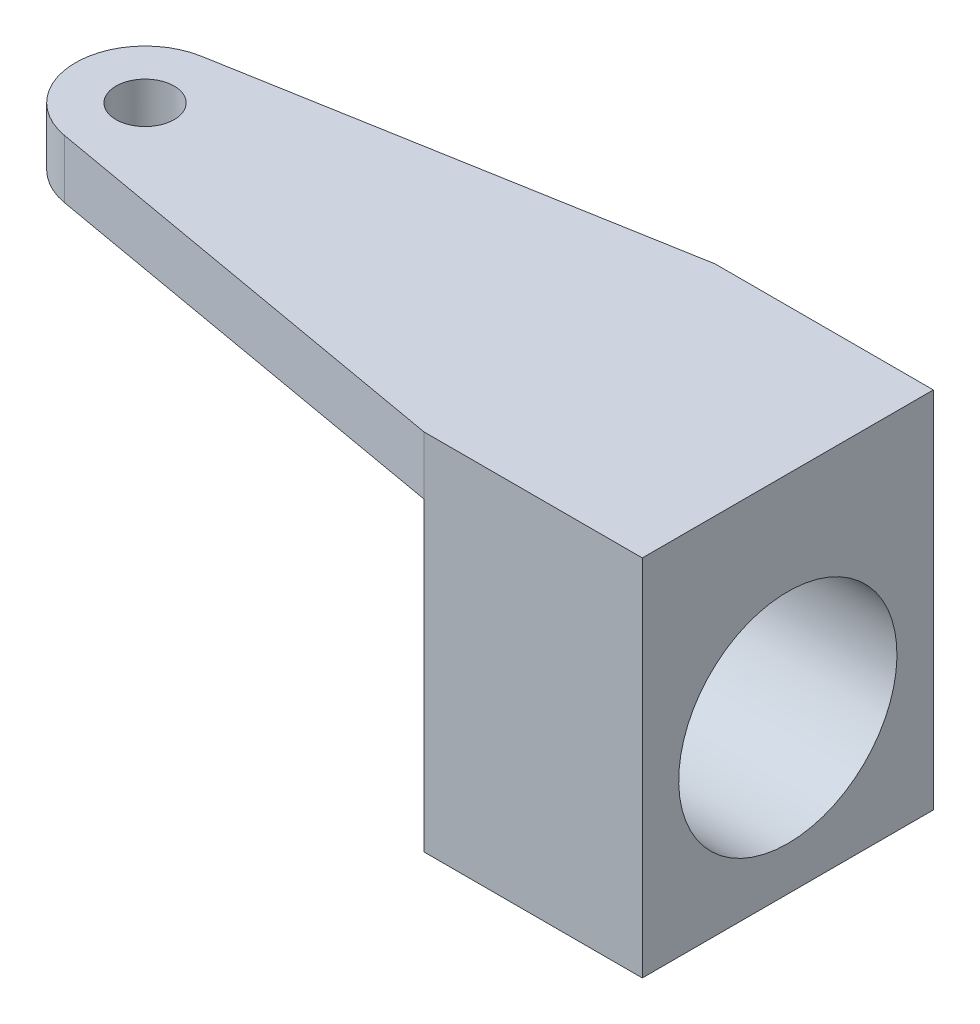
ISO-10303-21;
HEADER;
FILE_DESCRIPTION(('STEP AP214'),'2;1');
FILE_NAME('part.step','',(''),(''),'','','');
FILE_SCHEMA(('AUTOMOTIVE_DESIGN { 1 0 10303 214 1 1 1 1 }'));
ENDSEC;
DATA;
#1=APPLICATION_CONTEXT('core data for automotive mechanical design processes');
#2=APPLICATION_PROTOCOL_DEFINITION('international standard','automotive_design',2000,#1);
#3=PRODUCT_CONTEXT('',#1,'mechanical');
#4=PRODUCT('Part','Part','',(#3));
#5=PRODUCT_RELATED_PRODUCT_CATEGORY('part','',(#4));
#6=PRODUCT_DEFINITION_FORMATION('','',#4);
#7=PRODUCT_DEFINITION_CONTEXT('part definition',#1,'design');
#8=PRODUCT_DEFINITION('design','',#6,#7);
#9=PRODUCT_DEFINITION_SHAPE('','',#8);
#10=(LENGTH_UNIT() NAMED_UNIT(*) SI_UNIT(.MILLI.,.METRE.));
#11=(NAMED_UNIT(*) PLANE_ANGLE_UNIT() SI_UNIT($,.RADIAN.));
#12=(NAMED_UNIT(*) SI_UNIT($,.STERADIAN.) SOLID_ANGLE_UNIT());
#13=UNCERTAINTY_MEASURE_WITH_UNIT(LENGTH_MEASURE(1.E-05),#10,'distance_accuracy_value','');
#14=(GEOMETRIC_REPRESENTATION_CONTEXT(3) GLOBAL_UNCERTAINTY_ASSIGNED_CONTEXT((#13)) GLOBAL_UNIT_ASSIGNED_CONTEXT((#10,
#11,#12)) REPRESENTATION_CONTEXT('',''));
#15=CARTESIAN_POINT('',(0.,0.,0.));
#16=DIRECTION('',(0.,0.,1.));
#17=DIRECTION('',(1.,0.,0.));
#18=AXIS2_PLACEMENT_3D('',#15,#16,#17);
#19=CARTESIAN_POINT('',(0.,-125.,0.));
#20=DIRECTION('',(0.,1.,0.));
#21=DIRECTION('',(0.,0.,1.));
#22=AXIS2_PLACEMENT_3D('',#19,#20,#21);
#23=PLANE('',#22);
#24=DIRECTION('',(-1.,0.,0.));
#25=VECTOR('',#24,1.);
#26=CARTESIAN_POINT('',(145.847331583441,-125.,50.));
#27=LINE('',#26,#25);
#28=CARTESIAN_POINT('',(220.847331583441,-125.,50.));
#29=VERTEX_POINT('',#28);
#30=CARTESIAN_POINT('',(145.847331583441,-125.,50.));
#31=VERTEX_POINT('',#30);
#32=EDGE_CURVE('E167',#29,#31,#27,.T.);
#33=ORIENTED_EDGE('',*,*,#32,.T.);
#34=DIRECTION('',(0.,0.,1.));
#35=VECTOR('',#34,1.);
#36=CARTESIAN_POINT('',(145.847331583441,-125.,-50.));
#37=LINE('',#36,#35);
#38=CARTESIAN_POINT('',(145.847331583441,-125.,-50.));
#39=VERTEX_POINT('',#38);
#40=EDGE_CURVE('E161',#39,#31,#37,.T.);
#41=ORIENTED_EDGE('',*,*,#40,.F.);
#42=DIRECTION('',(1.,0.,0.));
#43=VECTOR('',#42,1.);
#44=CARTESIAN_POINT('',(220.847331583441,-125.,-50.));
#45=LINE('',#44,#43);
#46=CARTESIAN_POINT('',(220.847331583441,-125.,-50.));
#47=VERTEX_POINT('',#46);
#48=EDGE_CURVE('E61',#39,#47,#45,.T.);
#49=ORIENTED_EDGE('',*,*,#48,.T.);
#50=DIRECTION('',(0.,0.,1.));
#51=VECTOR('',#50,1.);
#52=CARTESIAN_POINT('',(220.847331583441,-125.,50.));
#53=LINE('',#52,#51);
#54=EDGE_CURVE('E98',#47,#29,#53,.T.);
#55=ORIENTED_EDGE('',*,*,#54,.T.);
#56=EDGE_LOOP('',(#33,#41,#49,#55));
#57=FACE_BOUND('',#56,.T.);
#58=ADVANCED_FACE('F36',(#57),#23,.F.);
#59=CARTESIAN_POINT('',(0.,0.,0.));
#60=DIRECTION('',(0.,1.,0.));
#61=DIRECTION('',(0.,0.,1.));
#62=AXIS2_PLACEMENT_3D('',#59,#60,#61);
#63=PLANE('',#62);
#64=DIRECTION('',(0.,0.,1.));
#65=VECTOR('',#64,1.);
#66=CARTESIAN_POINT('',(220.847331583441,0.,50.));
#67=LINE('',#66,#65);
#68=CARTESIAN_POINT('',(220.847331583441,0.,-50.));
#69=VERTEX_POINT('',#68);
#70=CARTESIAN_POINT('',(220.847331583441,0.,50.));
#71=VERTEX_POINT('',#70);
#72=EDGE_CURVE('E104',#69,#71,#67,.T.);
#73=ORIENTED_EDGE('',*,*,#72,.F.);
#74=DIRECTION('',(1.,0.,0.));
#75=VECTOR('',#74,1.);
#76=CARTESIAN_POINT('',(220.847331583441,0.,-50.));
#77=LINE('',#76,#75);
#78=CARTESIAN_POINT('',(145.847331583441,0.,-50.));
#79=VERTEX_POINT('',#78);
#80=EDGE_CURVE('E86',#79,#69,#77,.T.);
#81=ORIENTED_EDGE('',*,*,#80,.F.);
#82=DIRECTION('',(0.984807753012208,0.,-0.173648177666931));
#83=VECTOR('',#82,1.);
#84=CARTESIAN_POINT('',(145.847331583441,0.,-50.));
#85=LINE('',#84,#83);
#86=CARTESIAN_POINT('',(-4.15266841655876,0.,-23.5509528937301));
#87=VERTEX_POINT('',#86);
#88=EDGE_CURVE('E99',#87,#79,#85,.T.);
#89=ORIENTED_EDGE('',*,*,#88,.F.);
#90=CARTESIAN_POINT('',(0.,0.,0.));
#91=DIRECTION('',(0.,-1.,0.));
#92=DIRECTION('',(0.,0.,1.));
#93=AXIS2_PLACEMENT_3D('',#90,#91,#92);
#94=CIRCLE('',#93,23.9142643035612);
#95=CARTESIAN_POINT('',(-4.15266841655876,0.,23.5509528937301));
#96=VERTEX_POINT('',#95);
#97=EDGE_CURVE('E122',#96,#87,#94,.T.);
#98=ORIENTED_EDGE('',*,*,#97,.F.);
#99=DIRECTION('',(-0.984807753012208,0.,-0.173648177666931));
#100=VECTOR('',#99,1.);
#101=CARTESIAN_POINT('',(-4.15266841655877,0.,23.5509528937301));
#102=LINE('',#101,#100);
#103=CARTESIAN_POINT('',(145.847331583441,0.,50.));
#104=VERTEX_POINT('',#103);
#105=EDGE_CURVE('E113',#104,#96,#102,.T.);
#106=ORIENTED_EDGE('',*,*,#105,.F.);
#107=DIRECTION('',(-1.,0.,0.));
#108=VECTOR('',#107,1.);
#109=CARTESIAN_POINT('',(145.847331583441,0.,50.));
#110=LINE('',#109,#108);
#111=EDGE_CURVE('E110',#71,#104,#110,.T.);
#112=ORIENTED_EDGE('',*,*,#111,.F.);
#113=EDGE_LOOP('',(#73,#81,#89,#98,#106,#112));
#114=FACE_BOUND('',#113,.T.);
#115=CARTESIAN_POINT('',(0.,0.,0.));
#116=DIRECTION('',(0.,-1.,0.));
#117=DIRECTION('',(0.,0.,-1.));
#118=AXIS2_PLACEMENT_3D('',#115,#116,#117);
#119=CIRCLE('',#118,10.);
#120=CARTESIAN_POINT('',(0.,0.,-10.));
#121=VERTEX_POINT('',#120);
#122=EDGE_CURVE('E111',#121,#121,#119,.T.);
#123=ORIENTED_EDGE('',*,*,#122,.T.);
#124=EDGE_LOOP('',(#123));
#125=FACE_BOUND('',#124,.T.);
#126=ADVANCED_FACE('F106',(#114,#125),#63,.T.);
#127=CARTESIAN_POINT('',(220.847331583441,-125.,50.));
#128=DIRECTION('',(-1.,0.,0.));
#129=DIRECTION('',(0.,0.,1.));
#130=AXIS2_PLACEMENT_3D('',#127,#128,#129);
#131=PLANE('',#130);
#132=CARTESIAN_POINT('',(220.847331583441,-72.5,0.));
#133=DIRECTION('',(-1.,0.,0.));
#134=DIRECTION('',(0.,-1.,0.));
#135=AXIS2_PLACEMENT_3D('',#132,#133,#134);
#136=CIRCLE('',#135,37.5);
#137=CARTESIAN_POINT('',(220.847331583441,-110.,0.));
#138=VERTEX_POINT('',#137);
#139=EDGE_CURVE('E165',#138,#138,#136,.T.);
#140=ORIENTED_EDGE('',*,*,#139,.T.);
#141=EDGE_LOOP('',(#140));
#142=FACE_BOUND('',#141,.T.);
#143=ORIENTED_EDGE('',*,*,#72,.T.);
#144=DIRECTION('',(0.,1.,0.));
#145=VECTOR('',#144,1.);
#146=CARTESIAN_POINT('',(220.847331583441,-125.,50.));
#147=LINE('',#146,#145);
#148=EDGE_CURVE('E12',#29,#71,#147,.T.);
#149=ORIENTED_EDGE('',*,*,#148,.F.);
#150=ORIENTED_EDGE('',*,*,#54,.F.);
#151=DIRECTION('',(0.,1.,0.));
#152=VECTOR('',#151,1.);
#153=CARTESIAN_POINT('',(220.847331583441,-125.,-50.));
#154=LINE('',#153,#152);
#155=EDGE_CURVE('E89',#47,#69,#154,.T.);
#156=ORIENTED_EDGE('',*,*,#155,.T.);
#157=EDGE_LOOP('',(#143,#149,#150,#156));
#158=FACE_BOUND('',#157,.T.);
#159=ADVANCED_FACE('F38',(#142,#158),#131,.F.);
#160=CARTESIAN_POINT('',(145.847331583441,-125.,50.));
#161=DIRECTION('',(0.,0.,-1.));
#162=DIRECTION('',(-1.,0.,0.));
#163=AXIS2_PLACEMENT_3D('',#160,#161,#162);
#164=PLANE('',#163);
#165=ORIENTED_EDGE('',*,*,#111,.T.);
#166=DIRECTION('',(0.,1.,0.));
#167=VECTOR('',#166,1.);
#168=CARTESIAN_POINT('',(145.847331583441,-125.,50.));
#169=LINE('',#168,#167);
#170=CARTESIAN_POINT('',(145.847331583441,-20.,50.));
#171=VERTEX_POINT('',#170);
#172=EDGE_CURVE('E132',#171,#104,#169,.T.);
#173=ORIENTED_EDGE('',*,*,#172,.F.);
#174=EDGE_CURVE('E45',#31,#171,#169,.T.);
#175=ORIENTED_EDGE('',*,*,#174,.F.);
#176=ORIENTED_EDGE('',*,*,#32,.F.);
#177=ORIENTED_EDGE('',*,*,#148,.T.);
#178=EDGE_LOOP('',(#165,#173,#175,#176,#177));
#179=FACE_BOUND('',#178,.T.);
#180=ADVANCED_FACE('F147',(#179),#164,.F.);
#181=CARTESIAN_POINT('',(-4.15266841655877,-125.,23.5509528937301));
#182=DIRECTION('',(0.173648177666931,0.,-0.984807753012208));
#183=DIRECTION('',(-0.984807753012208,0.,-0.173648177666931));
#184=AXIS2_PLACEMENT_3D('',#181,#182,#183);
#185=PLANE('',#184);
#186=DIRECTION('',(0.,1.,0.));
#187=VECTOR('',#186,1.);
#188=CARTESIAN_POINT('',(-4.15266841655876,-125.,23.5509528937301));
#189=LINE('',#188,#187);
#190=CARTESIAN_POINT('',(-4.15266841655879,-20.,23.5509528937301));
#191=VERTEX_POINT('',#190);
#192=EDGE_CURVE('E130',#191,#96,#189,.T.);
#193=ORIENTED_EDGE('',*,*,#192,.F.);
#194=DIRECTION('',(-0.984807753012208,0.,-0.173648177666931));
#195=VECTOR('',#194,1.);
#196=CARTESIAN_POINT('',(145.847331583441,-20.,50.));
#197=LINE('',#196,#195);
#198=EDGE_CURVE('E145',#171,#191,#197,.T.);
#199=ORIENTED_EDGE('',*,*,#198,.F.);
#200=ORIENTED_EDGE('',*,*,#172,.T.);
#201=ORIENTED_EDGE('',*,*,#105,.T.);
#202=EDGE_LOOP('',(#193,#199,#200,#201));
#203=FACE_BOUND('',#202,.T.);
#204=ADVANCED_FACE('F142',(#203),#185,.F.);
#205=CARTESIAN_POINT('',(0.,-125.,0.));
#206=DIRECTION('',(0.,1.,0.));
#207=DIRECTION('',(0.,0.,1.));
#208=AXIS2_PLACEMENT_3D('',#205,#206,#207);
#209=CYLINDRICAL_SURFACE('',#208,23.9142643035612);
#210=DIRECTION('',(0.,1.,0.));
#211=VECTOR('',#210,1.);
#212=CARTESIAN_POINT('',(-4.15266841655876,-125.,-23.5509528937301));
#213=LINE('',#212,#211);
#214=CARTESIAN_POINT('',(-4.15266841655878,-20.,-23.5509528937301));
#215=VERTEX_POINT('',#214);
#216=EDGE_CURVE('E128',#215,#87,#213,.T.);
#217=ORIENTED_EDGE('',*,*,#216,.F.);
#218=CARTESIAN_POINT('',(0.,-20.,0.));
#219=DIRECTION('',(0.,1.,0.));
#220=DIRECTION('',(0.,0.,1.));
#221=AXIS2_PLACEMENT_3D('',#218,#219,#220);
#222=CIRCLE('',#221,23.9142643035612);
#223=EDGE_CURVE('E154',#191,#215,#222,.F.);
#224=ORIENTED_EDGE('',*,*,#223,.F.);
#225=ORIENTED_EDGE('',*,*,#192,.T.);
#226=ORIENTED_EDGE('',*,*,#97,.T.);
#227=EDGE_LOOP('',(#217,#224,#225,#226));
#228=FACE_BOUND('',#227,.T.);
#229=ADVANCED_FACE('F150',(#228),#209,.T.);
#230=CARTESIAN_POINT('',(145.847331583441,-125.,-50.));
#231=DIRECTION('',(0.173648177666931,0.,0.984807753012208));
#232=DIRECTION('',(0.984807753012208,0.,-0.173648177666931));
#233=AXIS2_PLACEMENT_3D('',#230,#231,#232);
#234=PLANE('',#233);
#235=DIRECTION('',(0.,1.,0.));
#236=VECTOR('',#235,1.);
#237=CARTESIAN_POINT('',(145.847331583441,-125.,-50.));
#238=LINE('',#237,#236);
#239=CARTESIAN_POINT('',(145.847331583441,-20.,-50.));
#240=VERTEX_POINT('',#239);
#241=EDGE_CURVE('E93',#240,#79,#238,.T.);
#242=ORIENTED_EDGE('',*,*,#241,.F.);
#243=DIRECTION('',(0.984807753012208,0.,-0.173648177666931));
#244=VECTOR('',#243,1.);
#245=CARTESIAN_POINT('',(-4.15266841655879,-20.,-23.5509528937301));
#246=LINE('',#245,#244);
#247=EDGE_CURVE('E52',#215,#240,#246,.T.);
#248=ORIENTED_EDGE('',*,*,#247,.F.);
#249=ORIENTED_EDGE('',*,*,#216,.T.);
#250=ORIENTED_EDGE('',*,*,#88,.T.);
#251=EDGE_LOOP('',(#242,#248,#249,#250));
#252=FACE_BOUND('',#251,.T.);
#253=ADVANCED_FACE('F206',(#252),#234,.F.);
#254=CARTESIAN_POINT('',(220.847331583441,-125.,-50.));
#255=DIRECTION('',(0.,0.,1.));
#256=DIRECTION('',(1.,0.,0.));
#257=AXIS2_PLACEMENT_3D('',#254,#255,#256);
#258=PLANE('',#257);
#259=ORIENTED_EDGE('',*,*,#80,.T.);
#260=ORIENTED_EDGE('',*,*,#155,.F.);
#261=ORIENTED_EDGE('',*,*,#48,.F.);
#262=EDGE_CURVE('E126',#39,#240,#238,.T.);
#263=ORIENTED_EDGE('',*,*,#262,.T.);
#264=ORIENTED_EDGE('',*,*,#241,.T.);
#265=EDGE_LOOP('',(#259,#260,#261,#263,#264));
#266=FACE_BOUND('',#265,.T.);
#267=ADVANCED_FACE('F88',(#266),#258,.F.);
#268=CARTESIAN_POINT('',(0.,-125.,0.));
#269=DIRECTION('',(0.,1.,0.));
#270=DIRECTION('',(0.,0.,1.));
#271=AXIS2_PLACEMENT_3D('',#268,#269,#270);
#272=CYLINDRICAL_SURFACE('',#271,10.);
#273=CARTESIAN_POINT('',(0.,-20.,0.));
#274=DIRECTION('',(0.,1.,0.));
#275=DIRECTION('',(0.,0.,1.));
#276=AXIS2_PLACEMENT_3D('',#273,#274,#275);
#277=CIRCLE('',#276,10.);
#278=CARTESIAN_POINT('',(0.,-20.,10.));
#279=VERTEX_POINT('',#278);
#280=EDGE_CURVE('E40',#279,#279,#277,.T.);
#281=ORIENTED_EDGE('',*,*,#280,.F.);
#282=EDGE_LOOP('',(#281));
#283=FACE_BOUND('',#282,.T.);
#284=ORIENTED_EDGE('',*,*,#122,.F.);
#285=EDGE_LOOP('',(#284));
#286=FACE_BOUND('',#285,.T.);
#287=ADVANCED_FACE('F193',(#283,#286),#272,.F.);
#288=CARTESIAN_POINT('',(0.,-20.,0.));
#289=DIRECTION('',(0.,1.,0.));
#290=DIRECTION('',(0.,0.,1.));
#291=AXIS2_PLACEMENT_3D('',#288,#289,#290);
#292=PLANE('',#291);
#293=ORIENTED_EDGE('',*,*,#280,.T.);
#294=EDGE_LOOP('',(#293));
#295=FACE_BOUND('',#294,.T.);
#296=ORIENTED_EDGE('',*,*,#247,.T.);
#297=DIRECTION('',(0.,0.,1.));
#298=VECTOR('',#297,1.);
#299=CARTESIAN_POINT('',(145.847331583441,-20.,-50.));
#300=LINE('',#299,#298);
#301=EDGE_CURVE('E164',#240,#171,#300,.T.);
#302=ORIENTED_EDGE('',*,*,#301,.T.);
#303=ORIENTED_EDGE('',*,*,#198,.T.);
#304=ORIENTED_EDGE('',*,*,#223,.T.);
#305=EDGE_LOOP('',(#296,#302,#303,#304));
#306=FACE_BOUND('',#305,.T.);
#307=ADVANCED_FACE('F188',(#295,#306),#292,.F.);
#308=CARTESIAN_POINT('',(145.847331583441,197.025377649941,-50.));
#309=DIRECTION('',(1.,0.,0.));
#310=DIRECTION('',(0.,1.,0.));
#311=AXIS2_PLACEMENT_3D('',#308,#309,#310);
#312=PLANE('',#311);
#313=CARTESIAN_POINT('',(145.847331583441,-72.5,0.));
#314=DIRECTION('',(-1.,0.,0.));
#315=DIRECTION('',(0.,-1.,0.));
#316=AXIS2_PLACEMENT_3D('',#313,#314,#315);
#317=CIRCLE('',#316,37.5);
#318=CARTESIAN_POINT('',(145.847331583441,-110.,0.));
#319=VERTEX_POINT('',#318);
#320=EDGE_CURVE('E174',#319,#319,#317,.T.);
#321=ORIENTED_EDGE('',*,*,#320,.F.);
#322=EDGE_LOOP('',(#321));
#323=FACE_BOUND('',#322,.T.);
#324=ORIENTED_EDGE('',*,*,#262,.F.);
#325=ORIENTED_EDGE('',*,*,#40,.T.);
#326=ORIENTED_EDGE('',*,*,#174,.T.);
#327=ORIENTED_EDGE('',*,*,#301,.F.);
#328=EDGE_LOOP('',(#324,#325,#326,#327));
#329=FACE_BOUND('',#328,.T.);
#330=ADVANCED_FACE('F163',(#323,#329),#312,.F.);
#331=CARTESIAN_POINT('',(220.847331583441,-72.5,0.));
#332=DIRECTION('',(-1.,0.,0.));
#333=DIRECTION('',(0.,-1.,0.));
#334=AXIS2_PLACEMENT_3D('',#331,#332,#333);
#335=CYLINDRICAL_SURFACE('',#334,37.5);
#336=ORIENTED_EDGE('',*,*,#139,.F.);
#337=EDGE_LOOP('',(#336));
#338=FACE_BOUND('',#337,.T.);
#339=ORIENTED_EDGE('',*,*,#320,.T.);
#340=EDGE_LOOP('',(#339));
#341=FACE_BOUND('',#340,.T.);
#342=ADVANCED_FACE('F181',(#338,#341),#335,.F.);
#343=CLOSED_SHELL('',(#58,#126,#159,#180,#204,#229,#253,#267,#287,#307,#330,#342));
#344=MANIFOLD_SOLID_BREP('B2',#343);
#345=ADVANCED_BREP_SHAPE_REPRESENTATION('',(#18,#344),#14);
#346=SHAPE_DEFINITION_REPRESENTATION(#9,#345);
ENDSEC;
END-ISO-10303-21;
